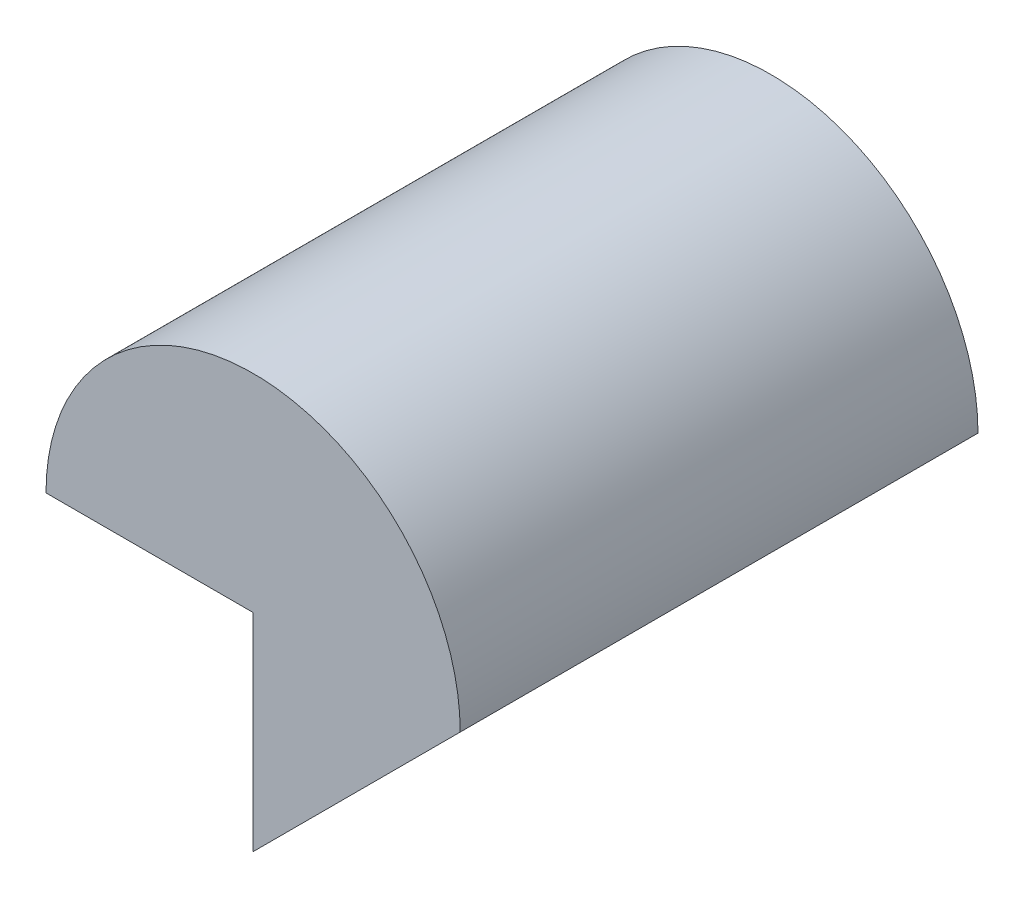
ISO-10303-21;
HEADER;
FILE_DESCRIPTION(('STEP AP214'),'2;1');
FILE_NAME('part.step','',(''),(''),'','','');
FILE_SCHEMA(('AUTOMOTIVE_DESIGN { 1 0 10303 214 1 1 1 1 }'));
ENDSEC;
DATA;
#1=APPLICATION_CONTEXT('core data for automotive mechanical design processes');
#2=APPLICATION_PROTOCOL_DEFINITION('international standard','automotive_design',2000,#1);
#3=PRODUCT_CONTEXT('',#1,'mechanical');
#4=PRODUCT('Part','Part','',(#3));
#5=PRODUCT_RELATED_PRODUCT_CATEGORY('part','',(#4));
#6=PRODUCT_DEFINITION_FORMATION('','',#4);
#7=PRODUCT_DEFINITION_CONTEXT('part definition',#1,'design');
#8=PRODUCT_DEFINITION('design','',#6,#7);
#9=PRODUCT_DEFINITION_SHAPE('','',#8);
#10=(LENGTH_UNIT() NAMED_UNIT(*) SI_UNIT(.MILLI.,.METRE.));
#11=(NAMED_UNIT(*) PLANE_ANGLE_UNIT() SI_UNIT($,.RADIAN.));
#12=(NAMED_UNIT(*) SI_UNIT($,.STERADIAN.) SOLID_ANGLE_UNIT());
#13=UNCERTAINTY_MEASURE_WITH_UNIT(LENGTH_MEASURE(1.E-05),#10,'distance_accuracy_value','');
#14=(GEOMETRIC_REPRESENTATION_CONTEXT(3) GLOBAL_UNCERTAINTY_ASSIGNED_CONTEXT((#13)) GLOBAL_UNIT_ASSIGNED_CONTEXT((#10,
#11,#12)) REPRESENTATION_CONTEXT('',''));
#15=CARTESIAN_POINT('',(0.,0.,0.));
#16=DIRECTION('',(0.,0.,1.));
#17=DIRECTION('',(1.,0.,0.));
#18=AXIS2_PLACEMENT_3D('',#15,#16,#17);
#19=CARTESIAN_POINT('',(-10.,-10.,25.));
#20=DIRECTION('',(-0.707106781186547,0.707106781186548,0.));
#21=DIRECTION('',(-0.707106781186548,-0.707106781186547,0.));
#22=AXIS2_PLACEMENT_3D('',#19,#20,#21);
#23=PLANE('',#22);
#24=DIRECTION('',(0.707106781186548,0.707106781186547,0.));
#25=VECTOR('',#24,1.);
#26=CARTESIAN_POINT('',(-10.,-10.,0.));
#27=LINE('',#26,#25);
#28=CARTESIAN_POINT('',(-10.,-10.,0.));
#29=VERTEX_POINT('',#28);
#30=CARTESIAN_POINT('',(0.,0.,0.));
#31=VERTEX_POINT('',#30);
#32=EDGE_CURVE('E96',#29,#31,#27,.T.);
#33=ORIENTED_EDGE('',*,*,#32,.T.);
#34=DIRECTION('',(0.,0.,-1.));
#35=VECTOR('',#34,1.);
#36=CARTESIAN_POINT('',(0.,0.,25.));
#37=LINE('',#36,#35);
#38=CARTESIAN_POINT('',(0.,0.,25.));
#39=VERTEX_POINT('',#38);
#40=EDGE_CURVE('E11',#39,#31,#37,.T.);
#41=ORIENTED_EDGE('',*,*,#40,.F.);
#42=DIRECTION('',(0.707106781186548,0.707106781186547,0.));
#43=VECTOR('',#42,1.);
#44=CARTESIAN_POINT('',(-10.,-10.,25.));
#45=LINE('',#44,#43);
#46=CARTESIAN_POINT('',(-10.,-10.,25.));
#47=VERTEX_POINT('',#46);
#48=EDGE_CURVE('E84',#47,#39,#45,.T.);
#49=ORIENTED_EDGE('',*,*,#48,.F.);
#50=DIRECTION('',(0.,0.,-1.));
#51=VECTOR('',#50,1.);
#52=CARTESIAN_POINT('',(-10.,-10.,25.));
#53=LINE('',#52,#51);
#54=EDGE_CURVE('E92',#47,#29,#53,.T.);
#55=ORIENTED_EDGE('',*,*,#54,.T.);
#56=EDGE_LOOP('',(#33,#41,#49,#55));
#57=FACE_BOUND('',#56,.T.);
#58=ADVANCED_FACE('F33',(#57),#23,.F.);
#59=CARTESIAN_POINT('',(-10.,0.,25.));
#60=DIRECTION('',(0.,0.,-1.));
#61=DIRECTION('',(-1.,0.,0.));
#62=AXIS2_PLACEMENT_3D('',#59,#60,#61);
#63=CYLINDRICAL_SURFACE('',#62,10.);
#64=CARTESIAN_POINT('',(-10.,0.,0.));
#65=DIRECTION('',(0.,0.,1.));
#66=DIRECTION('',(-1.,0.,0.));
#67=AXIS2_PLACEMENT_3D('',#64,#65,#66);
#68=CIRCLE('',#67,10.);
#69=CARTESIAN_POINT('',(-20.,0.,0.));
#70=VERTEX_POINT('',#69);
#71=EDGE_CURVE('E88',#31,#70,#68,.T.);
#72=ORIENTED_EDGE('',*,*,#71,.T.);
#73=DIRECTION('',(0.,0.,-1.));
#74=VECTOR('',#73,1.);
#75=CARTESIAN_POINT('',(-20.,0.,25.));
#76=LINE('',#75,#74);
#77=CARTESIAN_POINT('',(-20.,0.,25.));
#78=VERTEX_POINT('',#77);
#79=EDGE_CURVE('E41',#78,#70,#76,.T.);
#80=ORIENTED_EDGE('',*,*,#79,.F.);
#81=CARTESIAN_POINT('',(-10.,0.,25.));
#82=DIRECTION('',(0.,0.,1.));
#83=DIRECTION('',(-1.,0.,0.));
#84=AXIS2_PLACEMENT_3D('',#81,#82,#83);
#85=CIRCLE('',#84,10.);
#86=EDGE_CURVE('E79',#39,#78,#85,.T.);
#87=ORIENTED_EDGE('',*,*,#86,.F.);
#88=ORIENTED_EDGE('',*,*,#40,.T.);
#89=EDGE_LOOP('',(#72,#80,#87,#88));
#90=FACE_BOUND('',#89,.T.);
#91=ADVANCED_FACE('F87',(#90),#63,.T.);
#92=CARTESIAN_POINT('',(-10.,0.,25.));
#93=DIRECTION('',(0.,1.,0.));
#94=DIRECTION('',(-1.,0.,0.));
#95=AXIS2_PLACEMENT_3D('',#92,#93,#94);
#96=PLANE('',#95);
#97=DIRECTION('',(1.,0.,0.));
#98=VECTOR('',#97,1.);
#99=CARTESIAN_POINT('',(-10.,0.,0.));
#100=LINE('',#99,#98);
#101=CARTESIAN_POINT('',(-10.,0.,0.));
#102=VERTEX_POINT('',#101);
#103=EDGE_CURVE('E66',#70,#102,#100,.T.);
#104=ORIENTED_EDGE('',*,*,#103,.T.);
#105=DIRECTION('',(0.,0.,-1.));
#106=VECTOR('',#105,1.);
#107=CARTESIAN_POINT('',(-10.,0.,25.));
#108=LINE('',#107,#106);
#109=CARTESIAN_POINT('',(-10.,0.,25.));
#110=VERTEX_POINT('',#109);
#111=EDGE_CURVE('E89',#110,#102,#108,.T.);
#112=ORIENTED_EDGE('',*,*,#111,.F.);
#113=DIRECTION('',(1.,0.,0.));
#114=VECTOR('',#113,1.);
#115=CARTESIAN_POINT('',(-10.,0.,25.));
#116=LINE('',#115,#114);
#117=EDGE_CURVE('E82',#78,#110,#116,.T.);
#118=ORIENTED_EDGE('',*,*,#117,.F.);
#119=ORIENTED_EDGE('',*,*,#79,.T.);
#120=EDGE_LOOP('',(#104,#112,#118,#119));
#121=FACE_BOUND('',#120,.T.);
#122=ADVANCED_FACE('F90',(#121),#96,.F.);
#123=CARTESIAN_POINT('',(-10.,-10.,25.));
#124=DIRECTION('',(1.,0.,0.));
#125=DIRECTION('',(0.,1.,0.));
#126=AXIS2_PLACEMENT_3D('',#123,#124,#125);
#127=PLANE('',#126);
#128=DIRECTION('',(0.,-1.,0.));
#129=VECTOR('',#128,1.);
#130=CARTESIAN_POINT('',(-10.,-10.,0.));
#131=LINE('',#130,#129);
#132=EDGE_CURVE('E72',#102,#29,#131,.T.);
#133=ORIENTED_EDGE('',*,*,#132,.T.);
#134=ORIENTED_EDGE('',*,*,#54,.F.);
#135=DIRECTION('',(0.,-1.,0.));
#136=VECTOR('',#135,1.);
#137=CARTESIAN_POINT('',(-10.,-10.,25.));
#138=LINE('',#137,#136);
#139=EDGE_CURVE('E49',#110,#47,#138,.T.);
#140=ORIENTED_EDGE('',*,*,#139,.F.);
#141=ORIENTED_EDGE('',*,*,#111,.T.);
#142=EDGE_LOOP('',(#133,#134,#140,#141));
#143=FACE_BOUND('',#142,.T.);
#144=ADVANCED_FACE('F103',(#143),#127,.F.);
#145=CARTESIAN_POINT('',(-10.,0.,25.));
#146=DIRECTION('',(0.,0.,-1.));
#147=DIRECTION('',(-1.,0.,0.));
#148=AXIS2_PLACEMENT_3D('',#145,#146,#147);
#149=PLANE('',#148);
#150=ORIENTED_EDGE('',*,*,#48,.T.);
#151=ORIENTED_EDGE('',*,*,#86,.T.);
#152=ORIENTED_EDGE('',*,*,#117,.T.);
#153=ORIENTED_EDGE('',*,*,#139,.T.);
#154=EDGE_LOOP('',(#150,#151,#152,#153));
#155=FACE_BOUND('',#154,.T.);
#156=ADVANCED_FACE('F80',(#155),#149,.F.);
#157=CARTESIAN_POINT('',(-10.,0.,0.));
#158=DIRECTION('',(0.,0.,-1.));
#159=DIRECTION('',(-1.,0.,0.));
#160=AXIS2_PLACEMENT_3D('',#157,#158,#159);
#161=PLANE('',#160);
#162=ORIENTED_EDGE('',*,*,#32,.F.);
#163=ORIENTED_EDGE('',*,*,#132,.F.);
#164=ORIENTED_EDGE('',*,*,#103,.F.);
#165=ORIENTED_EDGE('',*,*,#71,.F.);
#166=EDGE_LOOP('',(#162,#163,#164,#165));
#167=FACE_BOUND('',#166,.T.);
#168=ADVANCED_FACE('F106',(#167),#161,.T.);
#169=CLOSED_SHELL('',(#58,#91,#122,#144,#156,#168));
#170=MANIFOLD_SOLID_BREP('B2',#169);
#171=ADVANCED_BREP_SHAPE_REPRESENTATION('',(#18,#170),#14);
#172=SHAPE_DEFINITION_REPRESENTATION(#9,#171);
ENDSEC;
END-ISO-10303-21;
